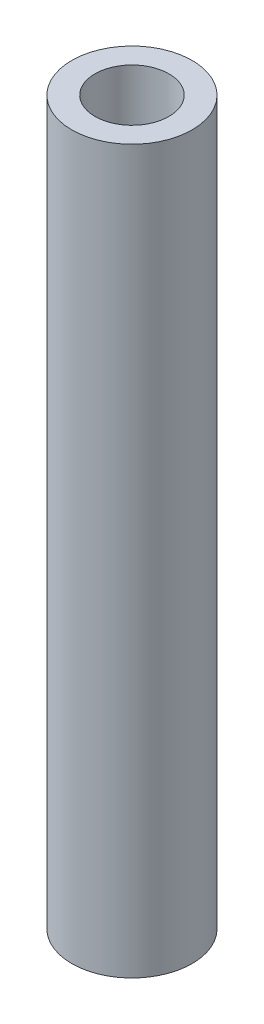
ISO-10303-21;
HEADER;
FILE_DESCRIPTION(('STEP AP214'),'2;1');
FILE_NAME('part.step','',(''),(''),'','','');
FILE_SCHEMA(('AUTOMOTIVE_DESIGN { 1 0 10303 214 1 1 1 1 }'));
ENDSEC;
DATA;
#1=APPLICATION_CONTEXT('core data for automotive mechanical design processes');
#2=APPLICATION_PROTOCOL_DEFINITION('international standard','automotive_design',2000,#1);
#3=PRODUCT_CONTEXT('',#1,'mechanical');
#4=PRODUCT('Part','Part','',(#3));
#5=PRODUCT_RELATED_PRODUCT_CATEGORY('part','',(#4));
#6=PRODUCT_DEFINITION_FORMATION('','',#4);
#7=PRODUCT_DEFINITION_CONTEXT('part definition',#1,'design');
#8=PRODUCT_DEFINITION('design','',#6,#7);
#9=PRODUCT_DEFINITION_SHAPE('','',#8);
#10=(LENGTH_UNIT() NAMED_UNIT(*) SI_UNIT(.MILLI.,.METRE.));
#11=(NAMED_UNIT(*) PLANE_ANGLE_UNIT() SI_UNIT($,.RADIAN.));
#12=(NAMED_UNIT(*) SI_UNIT($,.STERADIAN.) SOLID_ANGLE_UNIT());
#13=UNCERTAINTY_MEASURE_WITH_UNIT(LENGTH_MEASURE(1.E-05),#10,'distance_accuracy_value','');
#14=(GEOMETRIC_REPRESENTATION_CONTEXT(3) GLOBAL_UNCERTAINTY_ASSIGNED_CONTEXT((#13)) GLOBAL_UNIT_ASSIGNED_CONTEXT((#10,
#11,#12)) REPRESENTATION_CONTEXT('',''));
#15=CARTESIAN_POINT('',(0.,0.,0.));
#16=DIRECTION('',(0.,0.,1.));
#17=DIRECTION('',(1.,0.,0.));
#18=AXIS2_PLACEMENT_3D('',#15,#16,#17);
#19=CARTESIAN_POINT('',(0.,47.625,0.));
#20=DIRECTION('',(0.,1.,0.));
#21=DIRECTION('',(0.,0.,1.));
#22=AXIS2_PLACEMENT_3D('',#19,#20,#21);
#23=PLANE('',#22);
#24=CARTESIAN_POINT('',(0.,47.625,0.));
#25=DIRECTION('',(0.,1.,0.));
#26=DIRECTION('',(0.,0.,1.));
#27=AXIS2_PLACEMENT_3D('',#24,#25,#26);
#28=CIRCLE('',#27,3.96875);
#29=CARTESIAN_POINT('',(0.,47.625,3.96875));
#30=VERTEX_POINT('',#29);
#31=EDGE_CURVE('E10',#30,#30,#28,.T.);
#32=ORIENTED_EDGE('',*,*,#31,.T.);
#33=EDGE_LOOP('',(#32));
#34=FACE_BOUND('',#33,.T.);
#35=CARTESIAN_POINT('',(0.,47.625,0.));
#36=DIRECTION('',(0.,1.,0.));
#37=DIRECTION('',(0.,0.,1.));
#38=AXIS2_PLACEMENT_3D('',#35,#36,#37);
#39=CIRCLE('',#38,2.4384);
#40=CARTESIAN_POINT('',(0.,47.625,2.4384));
#41=VERTEX_POINT('',#40);
#42=EDGE_CURVE('E25',#41,#41,#39,.T.);
#43=ORIENTED_EDGE('',*,*,#42,.F.);
#44=EDGE_LOOP('',(#43));
#45=FACE_BOUND('',#44,.T.);
#46=ADVANCED_FACE('F14',(#34,#45),#23,.T.);
#47=CARTESIAN_POINT('',(0.,0.,0.));
#48=DIRECTION('',(0.,1.,0.));
#49=DIRECTION('',(0.,0.,1.));
#50=AXIS2_PLACEMENT_3D('',#47,#48,#49);
#51=PLANE('',#50);
#52=CARTESIAN_POINT('',(0.,0.,0.));
#53=DIRECTION('',(0.,1.,0.));
#54=DIRECTION('',(0.,0.,1.));
#55=AXIS2_PLACEMENT_3D('',#52,#53,#54);
#56=CIRCLE('',#55,3.96875);
#57=CARTESIAN_POINT('',(0.,0.,3.96875));
#58=VERTEX_POINT('',#57);
#59=EDGE_CURVE('E18',#58,#58,#56,.T.);
#60=ORIENTED_EDGE('',*,*,#59,.F.);
#61=EDGE_LOOP('',(#60));
#62=FACE_BOUND('',#61,.T.);
#63=CARTESIAN_POINT('',(0.,0.,0.));
#64=DIRECTION('',(0.,1.,0.));
#65=DIRECTION('',(0.,0.,1.));
#66=AXIS2_PLACEMENT_3D('',#63,#64,#65);
#67=CIRCLE('',#66,2.4384);
#68=CARTESIAN_POINT('',(0.,0.,2.4384));
#69=VERTEX_POINT('',#68);
#70=EDGE_CURVE('E27',#69,#69,#67,.T.);
#71=ORIENTED_EDGE('',*,*,#70,.T.);
#72=EDGE_LOOP('',(#71));
#73=FACE_BOUND('',#72,.T.);
#74=ADVANCED_FACE('F37',(#62,#73),#51,.F.);
#75=CARTESIAN_POINT('',(0.,47.625,0.));
#76=DIRECTION('',(0.,-1.,0.));
#77=DIRECTION('',(0.,0.,-1.));
#78=AXIS2_PLACEMENT_3D('',#75,#76,#77);
#79=CYLINDRICAL_SURFACE('',#78,3.96875);
#80=ORIENTED_EDGE('',*,*,#31,.F.);
#81=EDGE_LOOP('',(#80));
#82=FACE_BOUND('',#81,.T.);
#83=ORIENTED_EDGE('',*,*,#59,.T.);
#84=EDGE_LOOP('',(#83));
#85=FACE_BOUND('',#84,.T.);
#86=ADVANCED_FACE('F16',(#82,#85),#79,.T.);
#87=CARTESIAN_POINT('',(0.,47.625,0.));
#88=DIRECTION('',(0.,-1.,0.));
#89=DIRECTION('',(0.,0.,-1.));
#90=AXIS2_PLACEMENT_3D('',#87,#88,#89);
#91=CYLINDRICAL_SURFACE('',#90,2.4384);
#92=ORIENTED_EDGE('',*,*,#42,.T.);
#93=EDGE_LOOP('',(#92));
#94=FACE_BOUND('',#93,.T.);
#95=ORIENTED_EDGE('',*,*,#70,.F.);
#96=EDGE_LOOP('',(#95));
#97=FACE_BOUND('',#96,.T.);
#98=ADVANCED_FACE('F33',(#94,#97),#91,.F.);
#99=CLOSED_SHELL('',(#46,#74,#86,#98));
#100=MANIFOLD_SOLID_BREP('B1',#99);
#101=ADVANCED_BREP_SHAPE_REPRESENTATION('',(#18,#100),#14);
#102=SHAPE_DEFINITION_REPRESENTATION(#9,#101);
ENDSEC;
END-ISO-10303-21;
